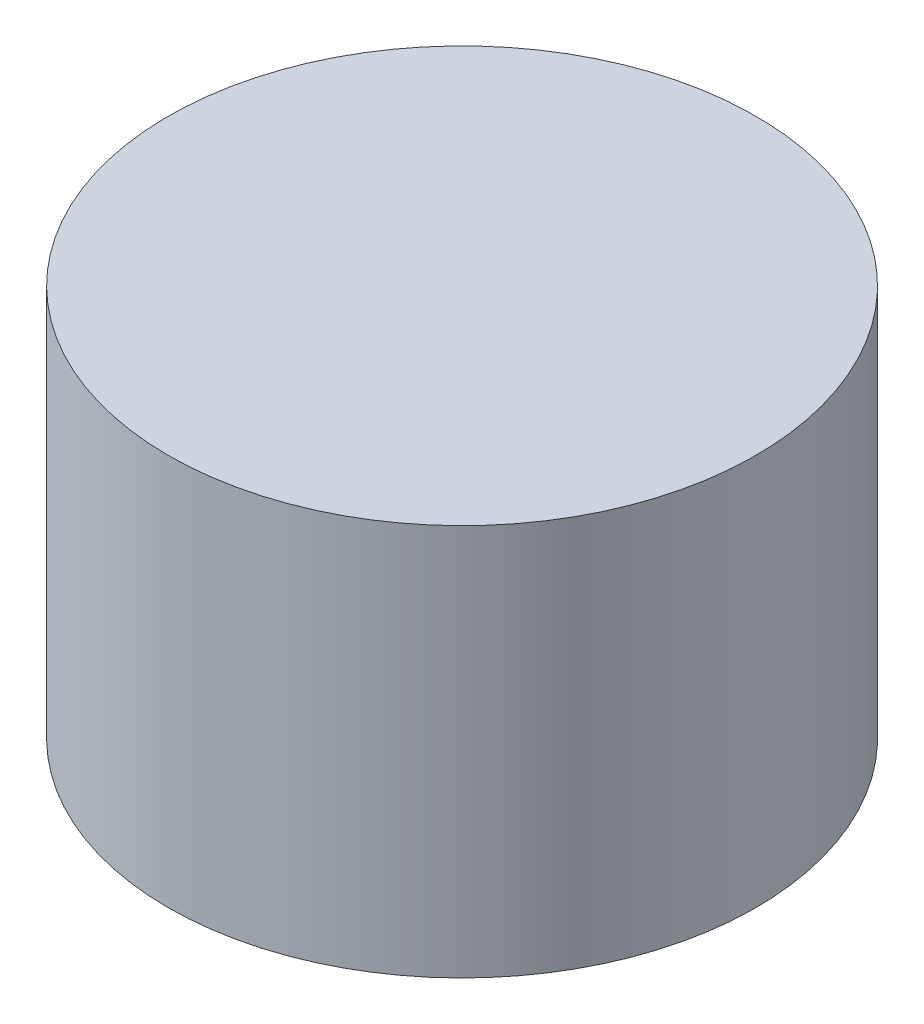
ISO-10303-21;
HEADER;
FILE_DESCRIPTION(('STEP AP214'),'2;1');
FILE_NAME('part.step','',(''),(''),'','','');
FILE_SCHEMA(('AUTOMOTIVE_DESIGN { 1 0 10303 214 1 1 1 1 }'));
ENDSEC;
DATA;
#1=APPLICATION_CONTEXT('core data for automotive mechanical design processes');
#2=APPLICATION_PROTOCOL_DEFINITION('international standard','automotive_design',2000,#1);
#3=PRODUCT_CONTEXT('',#1,'mechanical');
#4=PRODUCT('Part','Part','',(#3));
#5=PRODUCT_RELATED_PRODUCT_CATEGORY('part','',(#4));
#6=PRODUCT_DEFINITION_FORMATION('','',#4);
#7=PRODUCT_DEFINITION_CONTEXT('part definition',#1,'design');
#8=PRODUCT_DEFINITION('design','',#6,#7);
#9=PRODUCT_DEFINITION_SHAPE('','',#8);
#10=(LENGTH_UNIT() NAMED_UNIT(*) SI_UNIT(.MILLI.,.METRE.));
#11=(NAMED_UNIT(*) PLANE_ANGLE_UNIT() SI_UNIT($,.RADIAN.));
#12=(NAMED_UNIT(*) SI_UNIT($,.STERADIAN.) SOLID_ANGLE_UNIT());
#13=UNCERTAINTY_MEASURE_WITH_UNIT(LENGTH_MEASURE(1.E-05),#10,'distance_accuracy_value','');
#14=(GEOMETRIC_REPRESENTATION_CONTEXT(3) GLOBAL_UNCERTAINTY_ASSIGNED_CONTEXT((#13)) GLOBAL_UNIT_ASSIGNED_CONTEXT((#10,
#11,#12)) REPRESENTATION_CONTEXT('',''));
#15=CARTESIAN_POINT('',(0.,0.,0.));
#16=DIRECTION('',(0.,0.,1.));
#17=DIRECTION('',(1.,0.,0.));
#18=AXIS2_PLACEMENT_3D('',#15,#16,#17);
#19=CARTESIAN_POINT('',(0.,6.,0.));
#20=DIRECTION('',(0.,-1.,0.));
#21=DIRECTION('',(0.,0.,-1.));
#22=AXIS2_PLACEMENT_3D('',#19,#20,#21);
#23=CYLINDRICAL_SURFACE('',#22,4.5);
#24=CARTESIAN_POINT('',(0.,6.,0.));
#25=DIRECTION('',(0.,1.,0.));
#26=DIRECTION('',(0.,0.,1.));
#27=AXIS2_PLACEMENT_3D('',#24,#25,#26);
#28=CIRCLE('',#27,4.5);
#29=CARTESIAN_POINT('',(0.,6.,4.5));
#30=VERTEX_POINT('',#29);
#31=EDGE_CURVE('E10',#30,#30,#28,.T.);
#32=ORIENTED_EDGE('',*,*,#31,.F.);
#33=EDGE_LOOP('',(#32));
#34=FACE_BOUND('',#33,.T.);
#35=CARTESIAN_POINT('',(0.,0.,0.));
#36=DIRECTION('',(0.,1.,0.));
#37=DIRECTION('',(0.,0.,1.));
#38=AXIS2_PLACEMENT_3D('',#35,#36,#37);
#39=CIRCLE('',#38,4.5);
#40=CARTESIAN_POINT('',(0.,0.,4.5));
#41=VERTEX_POINT('',#40);
#42=EDGE_CURVE('E33',#41,#41,#39,.T.);
#43=ORIENTED_EDGE('',*,*,#42,.T.);
#44=EDGE_LOOP('',(#43));
#45=FACE_BOUND('',#44,.T.);
#46=ADVANCED_FACE('F30',(#34,#45),#23,.T.);
#47=CARTESIAN_POINT('',(0.,6.,0.));
#48=DIRECTION('',(0.,1.,0.));
#49=DIRECTION('',(0.,0.,1.));
#50=AXIS2_PLACEMENT_3D('',#47,#48,#49);
#51=PLANE('',#50);
#52=ORIENTED_EDGE('',*,*,#31,.T.);
#53=EDGE_LOOP('',(#52));
#54=FACE_BOUND('',#53,.T.);
#55=ADVANCED_FACE('F45',(#54),#51,.T.);
#56=CARTESIAN_POINT('',(0.,0.,0.));
#57=DIRECTION('',(0.,1.,0.));
#58=DIRECTION('',(0.,0.,1.));
#59=AXIS2_PLACEMENT_3D('',#56,#57,#58);
#60=PLANE('',#59);
#61=ORIENTED_EDGE('',*,*,#42,.F.);
#62=EDGE_LOOP('',(#61));
#63=FACE_BOUND('',#62,.T.);
#64=ADVANCED_FACE('F43',(#63),#60,.F.);
#65=CLOSED_SHELL('',(#46,#55,#64));
#66=MANIFOLD_SOLID_BREP('B2',#65);
#67=ADVANCED_BREP_SHAPE_REPRESENTATION('',(#18,#66),#14);
#68=SHAPE_DEFINITION_REPRESENTATION(#9,#67);
ENDSEC;
END-ISO-10303-21;
